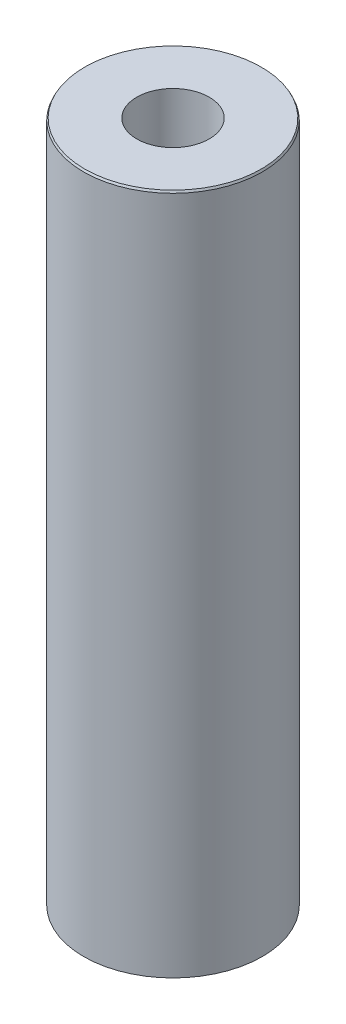
ISO-10303-21;
HEADER;
FILE_DESCRIPTION(('STEP AP214'),'2;1');
FILE_NAME('part.step','',(''),(''),'','','');
FILE_SCHEMA(('AUTOMOTIVE_DESIGN { 1 0 10303 214 1 1 1 1 }'));
ENDSEC;
DATA;
#1=APPLICATION_CONTEXT('core data for automotive mechanical design processes');
#2=APPLICATION_PROTOCOL_DEFINITION('international standard','automotive_design',2000,#1);
#3=PRODUCT_CONTEXT('',#1,'mechanical');
#4=PRODUCT('Part','Part','',(#3));
#5=PRODUCT_RELATED_PRODUCT_CATEGORY('part','',(#4));
#6=PRODUCT_DEFINITION_FORMATION('','',#4);
#7=PRODUCT_DEFINITION_CONTEXT('part definition',#1,'design');
#8=PRODUCT_DEFINITION('design','',#6,#7);
#9=PRODUCT_DEFINITION_SHAPE('','',#8);
#10=(LENGTH_UNIT() NAMED_UNIT(*) SI_UNIT(.MILLI.,.METRE.));
#11=(NAMED_UNIT(*) PLANE_ANGLE_UNIT() SI_UNIT($,.RADIAN.));
#12=(NAMED_UNIT(*) SI_UNIT($,.STERADIAN.) SOLID_ANGLE_UNIT());
#13=UNCERTAINTY_MEASURE_WITH_UNIT(LENGTH_MEASURE(1.E-05),#10,'distance_accuracy_value','');
#14=(GEOMETRIC_REPRESENTATION_CONTEXT(3) GLOBAL_UNCERTAINTY_ASSIGNED_CONTEXT((#13)) GLOBAL_UNIT_ASSIGNED_CONTEXT((#10,
#11,#12)) REPRESENTATION_CONTEXT('',''));
#15=CARTESIAN_POINT('',(0.,0.,0.));
#16=DIRECTION('',(0.,0.,1.));
#17=DIRECTION('',(1.,0.,0.));
#18=AXIS2_PLACEMENT_3D('',#15,#16,#17);
#19=CARTESIAN_POINT('',(0.,286.532527540228,0.));
#20=DIRECTION('',(0.,-1.,0.));
#21=DIRECTION('',(0.,0.,-1.));
#22=AXIS2_PLACEMENT_3D('',#19,#20,#21);
#23=CYLINDRICAL_SURFACE('',#22,37.5);
#24=CARTESIAN_POINT('',(0.,285.678023763974,0.));
#25=DIRECTION('',(0.,1.,0.));
#26=DIRECTION('',(0.,0.,1.));
#27=AXIS2_PLACEMENT_3D('',#24,#25,#26);
#28=CIRCLE('',#27,37.5);
#29=CARTESIAN_POINT('',(0.,285.678023763974,37.5));
#30=VERTEX_POINT('',#29);
#31=EDGE_CURVE('E50',#30,#30,#28,.F.);
#32=ORIENTED_EDGE('',*,*,#31,.T.);
#33=EDGE_LOOP('',(#32));
#34=FACE_BOUND('',#33,.T.);
#35=CARTESIAN_POINT('',(0.,0.420111811603341,0.));
#36=DIRECTION('',(0.,1.,0.));
#37=DIRECTION('',(0.,0.,1.));
#38=AXIS2_PLACEMENT_3D('',#35,#36,#37);
#39=CIRCLE('',#38,37.5);
#40=CARTESIAN_POINT('',(0.,0.420111811603341,37.5));
#41=VERTEX_POINT('',#40);
#42=EDGE_CURVE('E51',#41,#41,#39,.T.);
#43=ORIENTED_EDGE('',*,*,#42,.T.);
#44=EDGE_LOOP('',(#43));
#45=FACE_BOUND('',#44,.T.);
#46=ADVANCED_FACE('F39',(#34,#45),#23,.T.);
#47=CARTESIAN_POINT('',(0.,286.532527540228,0.));
#48=DIRECTION('',(0.,1.,0.));
#49=DIRECTION('',(0.,0.,1.));
#50=AXIS2_PLACEMENT_3D('',#47,#48,#49);
#51=PLANE('',#50);
#52=CARTESIAN_POINT('',(0.,286.532527540228,0.));
#53=DIRECTION('',(0.,1.,0.));
#54=DIRECTION('',(0.,0.,1.));
#55=AXIS2_PLACEMENT_3D('',#52,#53,#54);
#56=CIRCLE('',#55,37.0798881883967);
#57=CARTESIAN_POINT('',(0.,286.532527540228,37.0798881883967));
#58=VERTEX_POINT('',#57);
#59=EDGE_CURVE('E54',#58,#58,#56,.T.);
#60=ORIENTED_EDGE('',*,*,#59,.T.);
#61=EDGE_LOOP('',(#60));
#62=FACE_BOUND('',#61,.T.);
#63=CARTESIAN_POINT('',(0.,286.532527540228,0.));
#64=DIRECTION('',(0.,1.,0.));
#65=DIRECTION('',(0.,0.,1.));
#66=AXIS2_PLACEMENT_3D('',#63,#64,#65);
#67=CIRCLE('',#66,15.2140362102803);
#68=CARTESIAN_POINT('',(0.,286.532527540228,15.2140362102803));
#69=VERTEX_POINT('',#68);
#70=EDGE_CURVE('E58',#69,#69,#67,.T.);
#71=ORIENTED_EDGE('',*,*,#70,.F.);
#72=EDGE_LOOP('',(#71));
#73=FACE_BOUND('',#72,.T.);
#74=ADVANCED_FACE('F69',(#62,#73),#51,.T.);
#75=CARTESIAN_POINT('',(0.,0.,0.));
#76=DIRECTION('',(0.,1.,0.));
#77=DIRECTION('',(0.,0.,1.));
#78=AXIS2_PLACEMENT_3D('',#75,#76,#77);
#79=PLANE('',#78);
#80=CARTESIAN_POINT('',(0.,0.,0.));
#81=DIRECTION('',(0.,1.,0.));
#82=DIRECTION('',(0.,0.,1.));
#83=AXIS2_PLACEMENT_3D('',#80,#81,#82);
#84=CIRCLE('',#83,36.6454962237465);
#85=CARTESIAN_POINT('',(0.,0.,36.6454962237465));
#86=VERTEX_POINT('',#85);
#87=EDGE_CURVE('E10',#86,#86,#84,.F.);
#88=ORIENTED_EDGE('',*,*,#87,.T.);
#89=EDGE_LOOP('',(#88));
#90=FACE_BOUND('',#89,.T.);
#91=CARTESIAN_POINT('',(0.,0.,0.));
#92=DIRECTION('',(0.,1.,0.));
#93=DIRECTION('',(0.,0.,1.));
#94=AXIS2_PLACEMENT_3D('',#91,#92,#93);
#95=CIRCLE('',#94,15.2140362102803);
#96=CARTESIAN_POINT('',(0.,0.,15.2140362102803));
#97=VERTEX_POINT('',#96);
#98=EDGE_CURVE('E63',#97,#97,#95,.T.);
#99=ORIENTED_EDGE('',*,*,#98,.T.);
#100=EDGE_LOOP('',(#99));
#101=FACE_BOUND('',#100,.T.);
#102=ADVANCED_FACE('F75',(#90,#101),#79,.F.);
#103=CARTESIAN_POINT('',(0.,286.532527540228,0.));
#104=DIRECTION('',(0.,-1.,0.));
#105=DIRECTION('',(0.,0.,-1.));
#106=AXIS2_PLACEMENT_3D('',#103,#104,#105);
#107=CYLINDRICAL_SURFACE('',#106,15.2140362102803);
#108=ORIENTED_EDGE('',*,*,#70,.T.);
#109=EDGE_LOOP('',(#108));
#110=FACE_BOUND('',#109,.T.);
#111=ORIENTED_EDGE('',*,*,#98,.F.);
#112=EDGE_LOOP('',(#111));
#113=FACE_BOUND('',#112,.T.);
#114=ADVANCED_FACE('F70',(#110,#113),#107,.F.);
#115=CARTESIAN_POINT('',(0.,286.532527540228,0.));
#116=DIRECTION('',(0.,-1.,0.));
#117=DIRECTION('',(0.,0.,-1.));
#118=AXIS2_PLACEMENT_3D('',#115,#116,#117);
#119=CONICAL_SURFACE('',#118,37.0798881883967,0.456940639366564);
#120=ORIENTED_EDGE('',*,*,#31,.F.);
#121=EDGE_LOOP('',(#120));
#122=FACE_BOUND('',#121,.T.);
#123=ORIENTED_EDGE('',*,*,#59,.F.);
#124=EDGE_LOOP('',(#123));
#125=FACE_BOUND('',#124,.T.);
#126=ADVANCED_FACE('F81',(#122,#125),#119,.T.);
#127=CARTESIAN_POINT('',(0.,0.420111811603341,0.));
#128=DIRECTION('',(0.,1.,0.));
#129=DIRECTION('',(0.,0.,1.));
#130=AXIS2_PLACEMENT_3D('',#127,#128,#129);
#131=CONICAL_SURFACE('',#130,37.5,1.11385568742832);
#132=CARTESIAN_POINT('',(0.,0.,36.6454962237465));
#133=CARTESIAN_POINT('',(0.,0.00437616470420137,36.6543973047491));
#134=CARTESIAN_POINT('',(0.,0.00875232940840286,36.6632983857517));
#135=CARTESIAN_POINT('',(0.,0.0175046588168058,36.681100547757));
#136=CARTESIAN_POINT('',(0.,0.0218808235210073,36.6900016287597));
#137=CARTESIAN_POINT('',(0.,0.0306331529294102,36.7078037907649));
#138=CARTESIAN_POINT('',(0.,0.0350093176336115,36.7167048717676));
#139=CARTESIAN_POINT('',(0.,0.0437616470420148,36.7345070337729));
#140=CARTESIAN_POINT('',(0.,0.0481378117462167,36.7434081147755));
#141=CARTESIAN_POINT('',(0.,0.0568901411546194,36.7612102767808));
#142=CARTESIAN_POINT('',(0.,0.0612663058588202,36.7701113577834));
#143=CARTESIAN_POINT('',(0.,0.0700186352672228,36.7879135197887));
#144=CARTESIAN_POINT('',(0.,0.0743947999714247,36.7968146007914));
#145=CARTESIAN_POINT('',(0.,0.083147129379828,36.8146167627966));
#146=CARTESIAN_POINT('',(0.,0.0875232940840293,36.8235178437993));
#147=CARTESIAN_POINT('',(0.,0.0962756234924322,36.8413200058046));
#148=CARTESIAN_POINT('',(0.,0.100651788196634,36.8502210868072));
#149=CARTESIAN_POINT('',(0.,0.109404117605037,36.8680232488125));
#150=CARTESIAN_POINT('',(0.,0.113780282309238,36.8769243298151));
#151=CARTESIAN_POINT('',(0.,0.122532611717641,36.8947264918204));
#152=CARTESIAN_POINT('',(0.,0.126908776421843,36.9036275728231));
#153=CARTESIAN_POINT('',(0.,0.135661105830245,36.9214297348283));
#154=CARTESIAN_POINT('',(0.,0.140037270534447,36.930330815831));
#155=CARTESIAN_POINT('',(0.,0.14878959994285,36.9481329778363));
#156=CARTESIAN_POINT('',(0.,0.153165764647052,36.9570340588389));
#157=CARTESIAN_POINT('',(0.,0.161918094055455,36.9748362208442));
#158=CARTESIAN_POINT('',(0.,0.166294258759655,36.9837373018468));
#159=CARTESIAN_POINT('',(0.,0.175046588168058,37.0015394638521));
#160=CARTESIAN_POINT('',(0.,0.17942275287226,37.0104405448548));
#161=CARTESIAN_POINT('',(0.,0.188175082280663,37.02824270686));
#162=CARTESIAN_POINT('',(0.,0.192551246984865,37.0371437878627));
#163=CARTESIAN_POINT('',(0.,0.201303576393267,37.054945949868));
#164=CARTESIAN_POINT('',(0.,0.205679741097469,37.0638470308706));
#165=CARTESIAN_POINT('',(0.,0.214432070505872,37.0816491928759));
#166=CARTESIAN_POINT('',(0.,0.218808235210073,37.0905502738785));
#167=CARTESIAN_POINT('',(0.,0.227560564618476,37.1083524358838));
#168=CARTESIAN_POINT('',(0.,0.231936729322678,37.1172535168864));
#169=CARTESIAN_POINT('',(0.,0.240689058731081,37.1350556788917));
#170=CARTESIAN_POINT('',(0.,0.245065223435282,37.1439567598944));
#171=CARTESIAN_POINT('',(0.,0.253817552843685,37.1617589218996));
#172=CARTESIAN_POINT('',(0.,0.258193717547887,37.1706600029023));
#173=CARTESIAN_POINT('',(0.,0.26694604695629,37.1884621649076));
#174=CARTESIAN_POINT('',(0.,0.271322211660491,37.1973632459102));
#175=CARTESIAN_POINT('',(0.,0.280074541068893,37.2151654079155));
#176=CARTESIAN_POINT('',(0.,0.284450705773095,37.2240664889181));
#177=CARTESIAN_POINT('',(0.,0.293203035181498,37.2418686509234));
#178=CARTESIAN_POINT('',(0.,0.2975791998857,37.2507697319261));
#179=CARTESIAN_POINT('',(0.,0.306331529294103,37.2685718939313));
#180=CARTESIAN_POINT('',(0.,0.310707693998304,37.277472974934));
#181=CARTESIAN_POINT('',(0.,0.319460023406707,37.2952751369393));
#182=CARTESIAN_POINT('',(0.,0.323836188110909,37.3041762179419));
#183=CARTESIAN_POINT('',(0.,0.332588517519311,37.3219783799472));
#184=CARTESIAN_POINT('',(0.,0.336964682223513,37.3308794609498));
#185=CARTESIAN_POINT('',(0.,0.345717011631916,37.3486816229551));
#186=CARTESIAN_POINT('',(0.,0.350093176336117,37.3575827039577));
#187=CARTESIAN_POINT('',(0.,0.35884550574452,37.375384865963));
#188=CARTESIAN_POINT('',(0.,0.363221670448722,37.3842859469657));
#189=CARTESIAN_POINT('',(0.,0.371973999857125,37.402088108971));
#190=CARTESIAN_POINT('',(0.,0.376350164561326,37.4109891899736));
#191=CARTESIAN_POINT('',(0.,0.385102493969729,37.4287913519789));
#192=CARTESIAN_POINT('',(0.,0.38947865867393,37.4376924329815));
#193=CARTESIAN_POINT('',(0.,0.398230988082334,37.4554945949868));
#194=CARTESIAN_POINT('',(0.,0.402607152786535,37.4643956759894));
#195=CARTESIAN_POINT('',(0.,0.411359482194938,37.4821978379947));
#196=CARTESIAN_POINT('',(0.,0.415735646899139,37.4910989189974));
#197=CARTESIAN_POINT('',(0.,0.420111811603341,37.5));
#198=B_SPLINE_CURVE_WITH_KNOTS('',3,(#132,#133,#134,#135,#136,#137,#138,#139,#140,#141,#142,
#143,#144,#145,#146,#147,#148,#149,#150,#151,#152,#153,#154,#155,#156,#157,#158,#159,#160,#161,
#162,#163,#164,#165,#166,#167,#168,#169,#170,#171,#172,#173,#174,#175,#176,#177,#178,#179,#180,
#181,#182,#183,#184,#185,#186,#187,#188,#189,#190,#191,#192,#193,#194,#195,#196,#197),
.UNSPECIFIED.,.F.,.F.,(4,2,2,2,2,2,2,2,2,2,2,2,2,2,2,2,2,2,2,2,2,2,2,2,2,2,2,2,2,2,2,2,4),(0.,
0.0297560169512796,0.0595120339025592,0.0892680508538387,0.119024067805118,0.148780084756404,
0.178536101707684,0.208292118658963,0.238048135610243,0.267804152561522,0.297560169512802,
0.327316186464082,0.357072203415361,0.386828220366647,0.416584237317927,0.446340254269206,
0.476096271220486,0.505852288171765,0.535608305123045,0.565364322074325,0.595120339025604,
0.62487635597689,0.65463237292817,0.684388389879449,0.714144406830729,0.743900423782008,
0.773656440733288,0.803412457684568,0.833168474635847,0.862924491587133,0.892680508538413,
0.922436525489692,0.952192542440972),.UNSPECIFIED.);
#199=EDGE_CURVE('BSEAM45',#86,#41,#198,.T.);
#200=ORIENTED_EDGE('',*,*,#87,.F.);
#201=ORIENTED_EDGE('',*,*,#42,.F.);
#202=ORIENTED_EDGE('',*,*,#199,.T.);
#203=ORIENTED_EDGE('',*,*,#199,.F.);
#204=EDGE_LOOP('',(#200,#202,#201,#203));
#205=FACE_BOUND('',#204,.T.);
#206=ADVANCED_FACE('F45',(#205),#131,.T.);
#207=CLOSED_SHELL('',(#46,#74,#102,#114,#126,#206));
#208=MANIFOLD_SOLID_BREP('B2',#207);
#209=ADVANCED_BREP_SHAPE_REPRESENTATION('',(#18,#208),#14);
#210=SHAPE_DEFINITION_REPRESENTATION(#9,#209);
ENDSEC;
END-ISO-10303-21;
